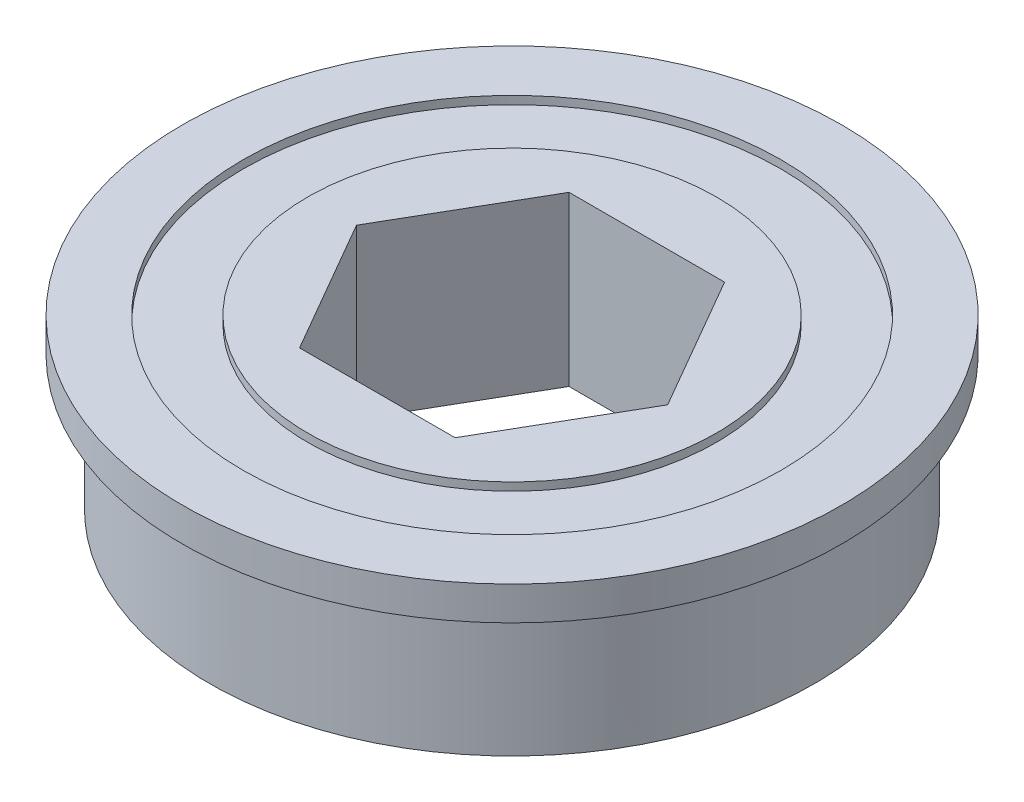
ISO-10303-21;
HEADER;
FILE_DESCRIPTION(('STEP AP214'),'2;1');
FILE_NAME('part.step','',(''),(''),'','','');
FILE_SCHEMA(('AUTOMOTIVE_DESIGN { 1 0 10303 214 1 1 1 1 }'));
ENDSEC;
DATA;
#1=APPLICATION_CONTEXT('core data for automotive mechanical design processes');
#2=APPLICATION_PROTOCOL_DEFINITION('international standard','automotive_design',2000,#1);
#3=PRODUCT_CONTEXT('',#1,'mechanical');
#4=PRODUCT('Part','Part','',(#3));
#5=PRODUCT_RELATED_PRODUCT_CATEGORY('part','',(#4));
#6=PRODUCT_DEFINITION_FORMATION('','',#4);
#7=PRODUCT_DEFINITION_CONTEXT('part definition',#1,'design');
#8=PRODUCT_DEFINITION('design','',#6,#7);
#9=PRODUCT_DEFINITION_SHAPE('','',#8);
#10=(LENGTH_UNIT() NAMED_UNIT(*) SI_UNIT(.MILLI.,.METRE.));
#11=(NAMED_UNIT(*) PLANE_ANGLE_UNIT() SI_UNIT($,.RADIAN.));
#12=(NAMED_UNIT(*) SI_UNIT($,.STERADIAN.) SOLID_ANGLE_UNIT());
#13=UNCERTAINTY_MEASURE_WITH_UNIT(LENGTH_MEASURE(1.E-05),#10,'distance_accuracy_value','');
#14=(GEOMETRIC_REPRESENTATION_CONTEXT(3) GLOBAL_UNCERTAINTY_ASSIGNED_CONTEXT((#13)) GLOBAL_UNIT_ASSIGNED_CONTEXT((#10,
#11,#12)) REPRESENTATION_CONTEXT('',''));
#15=CARTESIAN_POINT('',(0.,0.,0.));
#16=DIRECTION('',(0.,0.,1.));
#17=DIRECTION('',(1.,0.,0.));
#18=AXIS2_PLACEMENT_3D('',#15,#16,#17);
#19=CARTESIAN_POINT('',(3.67194771204602,0.,-6.36));
#20=DIRECTION('',(0.,0.,-1.));
#21=DIRECTION('',(-1.,0.,0.));
#22=AXIS2_PLACEMENT_3D('',#19,#20,#21);
#23=PLANE('',#22);
#24=DIRECTION('',(-1.,0.,0.));
#25=VECTOR('',#24,1.);
#26=CARTESIAN_POINT('',(3.67194771204602,7.9375,-6.36));
#27=LINE('',#26,#25);
#28=CARTESIAN_POINT('',(3.67194771204602,7.9375,-6.36));
#29=VERTEX_POINT('',#28);
#30=CARTESIAN_POINT('',(-3.67194771204602,7.9375,-6.36));
#31=VERTEX_POINT('',#30);
#32=EDGE_CURVE('E210',#29,#31,#27,.T.);
#33=ORIENTED_EDGE('',*,*,#32,.T.);
#34=DIRECTION('',(0.,1.,0.));
#35=VECTOR('',#34,1.);
#36=CARTESIAN_POINT('',(-3.67194771204602,0.,-6.36));
#37=LINE('',#36,#35);
#38=CARTESIAN_POINT('',(-3.67194771204602,0.,-6.36));
#39=VERTEX_POINT('',#38);
#40=EDGE_CURVE('E11',#39,#31,#37,.T.);
#41=ORIENTED_EDGE('',*,*,#40,.F.);
#42=DIRECTION('',(-1.,0.,0.));
#43=VECTOR('',#42,1.);
#44=CARTESIAN_POINT('',(3.67194771204602,0.,-6.36));
#45=LINE('',#44,#43);
#46=CARTESIAN_POINT('',(3.67194771204602,0.,-6.36));
#47=VERTEX_POINT('',#46);
#48=EDGE_CURVE('E175',#47,#39,#45,.T.);
#49=ORIENTED_EDGE('',*,*,#48,.F.);
#50=DIRECTION('',(0.,1.,0.));
#51=VECTOR('',#50,1.);
#52=CARTESIAN_POINT('',(3.67194771204602,0.,-6.36));
#53=LINE('',#52,#51);
#54=EDGE_CURVE('E211',#47,#29,#53,.T.);
#55=ORIENTED_EDGE('',*,*,#54,.T.);
#56=EDGE_LOOP('',(#33,#41,#49,#55));
#57=FACE_BOUND('',#56,.T.);
#58=ADVANCED_FACE('F17',(#57),#23,.F.);
#59=CARTESIAN_POINT('',(-3.67194771204602,0.,-6.36));
#60=DIRECTION('',(-0.866025403784439,0.,-0.5));
#61=DIRECTION('',(-0.5,0.,0.866025403784439));
#62=AXIS2_PLACEMENT_3D('',#59,#60,#61);
#63=PLANE('',#62);
#64=DIRECTION('',(-0.5,0.,0.866025403784439));
#65=VECTOR('',#64,1.);
#66=CARTESIAN_POINT('',(-3.67194771204602,7.9375,-6.36));
#67=LINE('',#66,#65);
#68=CARTESIAN_POINT('',(-7.34389542409204,7.9375,0.));
#69=VERTEX_POINT('',#68);
#70=EDGE_CURVE('E207',#31,#69,#67,.T.);
#71=ORIENTED_EDGE('',*,*,#70,.T.);
#72=DIRECTION('',(0.,1.,0.));
#73=VECTOR('',#72,1.);
#74=CARTESIAN_POINT('',(-7.34389542409204,0.,0.));
#75=LINE('',#74,#73);
#76=CARTESIAN_POINT('',(-7.34389542409204,0.,0.));
#77=VERTEX_POINT('',#76);
#78=EDGE_CURVE('E25',#77,#69,#75,.T.);
#79=ORIENTED_EDGE('',*,*,#78,.F.);
#80=DIRECTION('',(-0.5,0.,0.866025403784439));
#81=VECTOR('',#80,1.);
#82=CARTESIAN_POINT('',(-3.67194771204602,0.,-6.36));
#83=LINE('',#82,#81);
#84=EDGE_CURVE('E179',#39,#77,#83,.T.);
#85=ORIENTED_EDGE('',*,*,#84,.F.);
#86=ORIENTED_EDGE('',*,*,#40,.T.);
#87=EDGE_LOOP('',(#71,#79,#85,#86));
#88=FACE_BOUND('',#87,.T.);
#89=ADVANCED_FACE('F462',(#88),#63,.F.);
#90=CARTESIAN_POINT('',(-7.34389542409204,0.,0.));
#91=DIRECTION('',(-0.866025403784439,0.,0.5));
#92=DIRECTION('',(0.,1.,0.));
#93=AXIS2_PLACEMENT_3D('',#90,#91,#92);
#94=PLANE('',#93);
#95=DIRECTION('',(0.5,0.,0.866025403784439));
#96=VECTOR('',#95,1.);
#97=CARTESIAN_POINT('',(-7.34389542409204,7.9375,0.));
#98=LINE('',#97,#96);
#99=CARTESIAN_POINT('',(-3.67194771204601,7.9375,6.36));
#100=VERTEX_POINT('',#99);
#101=EDGE_CURVE('E204',#69,#100,#98,.T.);
#102=ORIENTED_EDGE('',*,*,#101,.T.);
#103=DIRECTION('',(0.,1.,0.));
#104=VECTOR('',#103,1.);
#105=CARTESIAN_POINT('',(-3.67194771204601,0.,6.36));
#106=LINE('',#105,#104);
#107=CARTESIAN_POINT('',(-3.67194771204601,0.,6.36));
#108=VERTEX_POINT('',#107);
#109=EDGE_CURVE('E220',#108,#100,#106,.T.);
#110=ORIENTED_EDGE('',*,*,#109,.F.);
#111=DIRECTION('',(0.5,0.,0.866025403784439));
#112=VECTOR('',#111,1.);
#113=CARTESIAN_POINT('',(-7.34389542409204,0.,0.));
#114=LINE('',#113,#112);
#115=EDGE_CURVE('E189',#77,#108,#114,.T.);
#116=ORIENTED_EDGE('',*,*,#115,.F.);
#117=ORIENTED_EDGE('',*,*,#78,.T.);
#118=EDGE_LOOP('',(#102,#110,#116,#117));
#119=FACE_BOUND('',#118,.T.);
#120=ADVANCED_FACE('F468',(#119),#94,.F.);
#121=CARTESIAN_POINT('',(-3.67194771204601,0.,6.36));
#122=DIRECTION('',(0.,0.,1.));
#123=DIRECTION('',(1.,0.,0.));
#124=AXIS2_PLACEMENT_3D('',#121,#122,#123);
#125=PLANE('',#124);
#126=DIRECTION('',(1.,0.,0.));
#127=VECTOR('',#126,1.);
#128=CARTESIAN_POINT('',(-3.67194771204601,7.9375,6.36));
#129=LINE('',#128,#127);
#130=CARTESIAN_POINT('',(3.67194771204602,7.9375,6.36));
#131=VERTEX_POINT('',#130);
#132=EDGE_CURVE('E200',#100,#131,#129,.T.);
#133=ORIENTED_EDGE('',*,*,#132,.T.);
#134=DIRECTION('',(0.,1.,0.));
#135=VECTOR('',#134,1.);
#136=CARTESIAN_POINT('',(3.67194771204602,0.,6.36));
#137=LINE('',#136,#135);
#138=CARTESIAN_POINT('',(3.67194771204602,0.,6.36));
#139=VERTEX_POINT('',#138);
#140=EDGE_CURVE('E217',#139,#131,#137,.T.);
#141=ORIENTED_EDGE('',*,*,#140,.F.);
#142=DIRECTION('',(1.,0.,0.));
#143=VECTOR('',#142,1.);
#144=CARTESIAN_POINT('',(-3.67194771204601,0.,6.36));
#145=LINE('',#144,#143);
#146=EDGE_CURVE('E185',#108,#139,#145,.T.);
#147=ORIENTED_EDGE('',*,*,#146,.F.);
#148=ORIENTED_EDGE('',*,*,#109,.T.);
#149=EDGE_LOOP('',(#133,#141,#147,#148));
#150=FACE_BOUND('',#149,.T.);
#151=ADVANCED_FACE('F489',(#150),#125,.F.);
#152=CARTESIAN_POINT('',(3.67194771204602,0.,6.36));
#153=DIRECTION('',(0.866025403784439,0.,0.5));
#154=DIRECTION('',(0.,-1.,0.));
#155=AXIS2_PLACEMENT_3D('',#152,#153,#154);
#156=PLANE('',#155);
#157=DIRECTION('',(0.5,0.,-0.866025403784439));
#158=VECTOR('',#157,1.);
#159=CARTESIAN_POINT('',(3.67194771204602,7.9375,6.36));
#160=LINE('',#159,#158);
#161=CARTESIAN_POINT('',(7.34389542409204,7.9375,0.));
#162=VERTEX_POINT('',#161);
#163=EDGE_CURVE('E196',#131,#162,#160,.T.);
#164=ORIENTED_EDGE('',*,*,#163,.T.);
#165=DIRECTION('',(0.,1.,0.));
#166=VECTOR('',#165,1.);
#167=CARTESIAN_POINT('',(7.34389542409204,0.,0.));
#168=LINE('',#167,#166);
#169=CARTESIAN_POINT('',(7.34389542409204,0.,0.));
#170=VERTEX_POINT('',#169);
#171=EDGE_CURVE('E214',#170,#162,#168,.T.);
#172=ORIENTED_EDGE('',*,*,#171,.F.);
#173=DIRECTION('',(0.5,0.,-0.866025403784439));
#174=VECTOR('',#173,1.);
#175=CARTESIAN_POINT('',(3.67194771204602,0.,6.36));
#176=LINE('',#175,#174);
#177=EDGE_CURVE('E180',#139,#170,#176,.T.);
#178=ORIENTED_EDGE('',*,*,#177,.F.);
#179=ORIENTED_EDGE('',*,*,#140,.T.);
#180=EDGE_LOOP('',(#164,#172,#178,#179));
#181=FACE_BOUND('',#180,.T.);
#182=ADVANCED_FACE('F487',(#181),#156,.F.);
#183=CARTESIAN_POINT('',(7.34389542409204,0.,0.));
#184=DIRECTION('',(0.866025403784439,0.,-0.5));
#185=DIRECTION('',(0.,-1.,0.));
#186=AXIS2_PLACEMENT_3D('',#183,#184,#185);
#187=PLANE('',#186);
#188=DIRECTION('',(-0.5,0.,-0.866025403784439));
#189=VECTOR('',#188,1.);
#190=CARTESIAN_POINT('',(7.34389542409204,7.9375,0.));
#191=LINE('',#190,#189);
#192=EDGE_CURVE('E184',#162,#29,#191,.T.);
#193=ORIENTED_EDGE('',*,*,#192,.T.);
#194=ORIENTED_EDGE('',*,*,#54,.F.);
#195=DIRECTION('',(-0.5,0.,-0.866025403784439));
#196=VECTOR('',#195,1.);
#197=CARTESIAN_POINT('',(7.34389542409204,0.,0.));
#198=LINE('',#197,#196);
#199=EDGE_CURVE('E174',#170,#47,#198,.T.);
#200=ORIENTED_EDGE('',*,*,#199,.F.);
#201=ORIENTED_EDGE('',*,*,#171,.T.);
#202=EDGE_LOOP('',(#193,#194,#200,#201));
#203=FACE_BOUND('',#202,.T.);
#204=ADVANCED_FACE('F484',(#203),#187,.F.);
#205=CARTESIAN_POINT('',(6.35,7.9375,0.));
#206=DIRECTION('',(0.,1.,0.));
#207=DIRECTION('',(1.,0.,0.));
#208=AXIS2_PLACEMENT_3D('',#205,#206,#207);
#209=PLANE('',#208);
#210=ORIENTED_EDGE('',*,*,#192,.F.);
#211=ORIENTED_EDGE('',*,*,#163,.F.);
#212=ORIENTED_EDGE('',*,*,#132,.F.);
#213=ORIENTED_EDGE('',*,*,#101,.F.);
#214=ORIENTED_EDGE('',*,*,#70,.F.);
#215=ORIENTED_EDGE('',*,*,#32,.F.);
#216=EDGE_LOOP('',(#210,#211,#212,#213,#214,#215));
#217=FACE_BOUND('',#216,.T.);
#218=CARTESIAN_POINT('',(0.,7.9375,0.));
#219=DIRECTION('',(0.,1.,0.));
#220=DIRECTION('',(0.,0.,1.));
#221=AXIS2_PLACEMENT_3D('',#218,#219,#220);
#222=CIRCLE('',#221,9.652);
#223=CARTESIAN_POINT('',(0.,7.9375,-9.652));
#224=VERTEX_POINT('',#223);
#225=EDGE_CURVE('E157',#224,#224,#222,.T.);
#226=ORIENTED_EDGE('',*,*,#225,.T.);
#227=EDGE_LOOP('',(#226));
#228=FACE_BOUND('',#227,.T.);
#229=ADVANCED_FACE('F475',(#217,#228),#209,.T.);
#230=CARTESIAN_POINT('',(9.652,0.,0.));
#231=DIRECTION('',(0.,-1.,0.));
#232=DIRECTION('',(0.,0.,-1.));
#233=AXIS2_PLACEMENT_3D('',#230,#231,#232);
#234=PLANE('',#233);
#235=ORIENTED_EDGE('',*,*,#199,.T.);
#236=ORIENTED_EDGE('',*,*,#48,.T.);
#237=ORIENTED_EDGE('',*,*,#84,.T.);
#238=ORIENTED_EDGE('',*,*,#115,.T.);
#239=ORIENTED_EDGE('',*,*,#146,.T.);
#240=ORIENTED_EDGE('',*,*,#177,.T.);
#241=EDGE_LOOP('',(#235,#236,#237,#238,#239,#240));
#242=FACE_BOUND('',#241,.T.);
#243=CARTESIAN_POINT('',(0.,0.,0.));
#244=DIRECTION('',(0.,1.,0.));
#245=DIRECTION('',(0.,0.,1.));
#246=AXIS2_PLACEMENT_3D('',#243,#244,#245);
#247=CIRCLE('',#246,9.652);
#248=CARTESIAN_POINT('',(0.,0.,-9.652));
#249=VERTEX_POINT('',#248);
#250=EDGE_CURVE('E384',#249,#249,#247,.T.);
#251=ORIENTED_EDGE('',*,*,#250,.F.);
#252=EDGE_LOOP('',(#251));
#253=FACE_BOUND('',#252,.T.);
#254=ADVANCED_FACE('F457',(#242,#253),#234,.T.);
#255=CARTESIAN_POINT('',(9.652,0.381,0.));
#256=DIRECTION('',(0.,-1.,0.));
#257=DIRECTION('',(0.,0.,-1.));
#258=AXIS2_PLACEMENT_3D('',#255,#256,#257);
#259=PLANE('',#258);
#260=CARTESIAN_POINT('',(0.,0.381,0.));
#261=DIRECTION('',(0.,1.,0.));
#262=DIRECTION('',(0.,0.,1.));
#263=AXIS2_PLACEMENT_3D('',#260,#261,#262);
#264=CIRCLE('',#263,9.652);
#265=CARTESIAN_POINT('',(0.,0.381,-9.652));
#266=VERTEX_POINT('',#265);
#267=EDGE_CURVE('E396',#266,#266,#264,.T.);
#268=ORIENTED_EDGE('',*,*,#267,.T.);
#269=EDGE_LOOP('',(#268));
#270=FACE_BOUND('',#269,.T.);
#271=CARTESIAN_POINT('',(0.,0.381,0.));
#272=DIRECTION('',(0.,1.,0.));
#273=DIRECTION('',(0.,0.,1.));
#274=AXIS2_PLACEMENT_3D('',#271,#272,#273);
#275=CIRCLE('',#274,12.7);
#276=CARTESIAN_POINT('',(0.,0.381,-12.7));
#277=VERTEX_POINT('',#276);
#278=EDGE_CURVE('E366',#277,#277,#275,.T.);
#279=ORIENTED_EDGE('',*,*,#278,.F.);
#280=EDGE_LOOP('',(#279));
#281=FACE_BOUND('',#280,.T.);
#282=ADVANCED_FACE('F446',(#270,#281),#259,.T.);
#283=CARTESIAN_POINT('',(14.2748,0.,0.));
#284=DIRECTION('',(0.,-1.,0.));
#285=DIRECTION('',(0.,0.,-1.));
#286=AXIS2_PLACEMENT_3D('',#283,#284,#285);
#287=PLANE('',#286);
#288=CARTESIAN_POINT('',(0.,0.,0.));
#289=DIRECTION('',(0.,1.,0.));
#290=DIRECTION('',(0.,0.,1.));
#291=AXIS2_PLACEMENT_3D('',#288,#289,#290);
#292=CIRCLE('',#291,12.7);
#293=CARTESIAN_POINT('',(0.,0.,-12.7));
#294=VERTEX_POINT('',#293);
#295=EDGE_CURVE('E378',#294,#294,#292,.T.);
#296=ORIENTED_EDGE('',*,*,#295,.T.);
#297=EDGE_LOOP('',(#296));
#298=FACE_BOUND('',#297,.T.);
#299=CARTESIAN_POINT('',(0.,0.,0.));
#300=DIRECTION('',(0.,1.,0.));
#301=DIRECTION('',(0.,0.,1.));
#302=AXIS2_PLACEMENT_3D('',#299,#300,#301);
#303=CIRCLE('',#302,14.2748);
#304=CARTESIAN_POINT('',(0.,0.,-14.2748));
#305=VERTEX_POINT('',#304);
#306=EDGE_CURVE('E338',#305,#305,#303,.T.);
#307=ORIENTED_EDGE('',*,*,#306,.F.);
#308=EDGE_LOOP('',(#307));
#309=FACE_BOUND('',#308,.T.);
#310=ADVANCED_FACE('F444',(#298,#309),#287,.T.);
#311=CARTESIAN_POINT('',(15.5575,6.35,0.));
#312=DIRECTION('',(0.,-1.,0.));
#313=DIRECTION('',(0.,0.,-1.));
#314=AXIS2_PLACEMENT_3D('',#311,#312,#313);
#315=PLANE('',#314);
#316=CARTESIAN_POINT('',(0.,6.35,0.));
#317=DIRECTION('',(0.,1.,0.));
#318=DIRECTION('',(0.,0.,1.));
#319=AXIS2_PLACEMENT_3D('',#316,#317,#318);
#320=CIRCLE('',#319,14.2748);
#321=CARTESIAN_POINT('',(0.,6.35,-14.2748));
#322=VERTEX_POINT('',#321);
#323=EDGE_CURVE('E420',#322,#322,#320,.T.);
#324=ORIENTED_EDGE('',*,*,#323,.T.);
#325=EDGE_LOOP('',(#324));
#326=FACE_BOUND('',#325,.T.);
#327=CARTESIAN_POINT('',(0.,6.35,0.));
#328=DIRECTION('',(0.,1.,0.));
#329=DIRECTION('',(0.,0.,1.));
#330=AXIS2_PLACEMENT_3D('',#327,#328,#329);
#331=CIRCLE('',#330,15.5575);
#332=CARTESIAN_POINT('',(0.,6.35,-15.5575));
#333=VERTEX_POINT('',#332);
#334=EDGE_CURVE('E314',#333,#333,#331,.T.);
#335=ORIENTED_EDGE('',*,*,#334,.F.);
#336=EDGE_LOOP('',(#335));
#337=FACE_BOUND('',#336,.T.);
#338=ADVANCED_FACE('F430',(#326,#337),#315,.T.);
#339=CARTESIAN_POINT('',(12.7,7.9375,0.));
#340=DIRECTION('',(0.,1.,0.));
#341=DIRECTION('',(1.,0.,0.));
#342=AXIS2_PLACEMENT_3D('',#339,#340,#341);
#343=PLANE('',#342);
#344=CARTESIAN_POINT('',(0.,7.9375,0.));
#345=DIRECTION('',(0.,1.,0.));
#346=DIRECTION('',(0.,0.,1.));
#347=AXIS2_PLACEMENT_3D('',#344,#345,#346);
#348=CIRCLE('',#347,12.7);
#349=CARTESIAN_POINT('',(0.,7.9375,-12.7));
#350=VERTEX_POINT('',#349);
#351=EDGE_CURVE('E150',#350,#350,#348,.T.);
#352=ORIENTED_EDGE('',*,*,#351,.F.);
#353=EDGE_LOOP('',(#352));
#354=FACE_BOUND('',#353,.T.);
#355=CARTESIAN_POINT('',(0.,7.9375,0.));
#356=DIRECTION('',(0.,1.,0.));
#357=DIRECTION('',(0.,0.,1.));
#358=AXIS2_PLACEMENT_3D('',#355,#356,#357);
#359=CIRCLE('',#358,15.5575);
#360=CARTESIAN_POINT('',(0.,7.9375,-15.5575));
#361=VERTEX_POINT('',#360);
#362=EDGE_CURVE('E325',#361,#361,#359,.T.);
#363=ORIENTED_EDGE('',*,*,#362,.T.);
#364=EDGE_LOOP('',(#363));
#365=FACE_BOUND('',#364,.T.);
#366=ADVANCED_FACE('F455',(#354,#365),#343,.T.);
#367=CARTESIAN_POINT('',(9.652,7.5565,0.));
#368=DIRECTION('',(0.,1.,0.));
#369=DIRECTION('',(1.,0.,0.));
#370=AXIS2_PLACEMENT_3D('',#367,#368,#369);
#371=PLANE('',#370);
#372=CARTESIAN_POINT('',(0.,7.5565,0.));
#373=DIRECTION('',(0.,1.,0.));
#374=DIRECTION('',(0.,0.,1.));
#375=AXIS2_PLACEMENT_3D('',#372,#373,#374);
#376=CIRCLE('',#375,9.652);
#377=CARTESIAN_POINT('',(0.,7.5565,-9.652));
#378=VERTEX_POINT('',#377);
#379=EDGE_CURVE('E171',#378,#378,#376,.T.);
#380=ORIENTED_EDGE('',*,*,#379,.F.);
#381=EDGE_LOOP('',(#380));
#382=FACE_BOUND('',#381,.T.);
#383=CARTESIAN_POINT('',(0.,7.5565,0.));
#384=DIRECTION('',(0.,1.,0.));
#385=DIRECTION('',(0.,0.,1.));
#386=AXIS2_PLACEMENT_3D('',#383,#384,#385);
#387=CIRCLE('',#386,12.7);
#388=CARTESIAN_POINT('',(0.,7.5565,-12.7));
#389=VERTEX_POINT('',#388);
#390=EDGE_CURVE('E167',#389,#389,#387,.T.);
#391=ORIENTED_EDGE('',*,*,#390,.T.);
#392=EDGE_LOOP('',(#391));
#393=FACE_BOUND('',#392,.T.);
#394=ADVANCED_FACE('F518',(#382,#393),#371,.T.);
#395=CARTESIAN_POINT('',(0.,0.,0.));
#396=DIRECTION('',(0.,1.,0.));
#397=DIRECTION('',(0.,0.,1.));
#398=AXIS2_PLACEMENT_3D('',#395,#396,#397);
#399=CYLINDRICAL_SURFACE('',#398,9.652);
#400=ORIENTED_EDGE('',*,*,#225,.F.);
#401=DIRECTION('',(0.,-1.,0.));
#402=VECTOR('',#401,1.);
#403=CARTESIAN_POINT('',(0.,0.,-9.652));
#404=LINE('',#403,#402);
#405=EDGE_CURVE('E165',#224,#378,#404,.T.);
#406=ORIENTED_EDGE('',*,*,#405,.T.);
#407=ORIENTED_EDGE('',*,*,#379,.T.);
#408=ORIENTED_EDGE('',*,*,#405,.F.);
#409=EDGE_LOOP('',(#400,#406,#407,#408));
#410=FACE_BOUND('',#409,.T.);
#411=ADVANCED_FACE('F515',(#410),#399,.T.);
#412=CARTESIAN_POINT('',(0.,0.,0.));
#413=DIRECTION('',(0.,1.,0.));
#414=DIRECTION('',(0.,0.,1.));
#415=AXIS2_PLACEMENT_3D('',#412,#413,#414);
#416=CYLINDRICAL_SURFACE('',#415,12.7);
#417=ORIENTED_EDGE('',*,*,#390,.F.);
#418=DIRECTION('',(0.,1.,0.));
#419=VECTOR('',#418,1.);
#420=CARTESIAN_POINT('',(0.,0.,-12.7));
#421=LINE('',#420,#419);
#422=EDGE_CURVE('E153',#389,#350,#421,.T.);
#423=ORIENTED_EDGE('',*,*,#422,.T.);
#424=ORIENTED_EDGE('',*,*,#351,.T.);
#425=ORIENTED_EDGE('',*,*,#422,.F.);
#426=EDGE_LOOP('',(#417,#423,#424,#425));
#427=FACE_BOUND('',#426,.T.);
#428=ADVANCED_FACE('F152',(#427),#416,.F.);
#429=CARTESIAN_POINT('',(0.,0.,0.));
#430=DIRECTION('',(0.,1.,0.));
#431=DIRECTION('',(0.,0.,1.));
#432=AXIS2_PLACEMENT_3D('',#429,#430,#431);
#433=CYLINDRICAL_SURFACE('',#432,15.5575);
#434=ORIENTED_EDGE('',*,*,#362,.F.);
#435=DIRECTION('',(0.,-1.,0.));
#436=VECTOR('',#435,1.);
#437=CARTESIAN_POINT('',(0.,0.,-15.5575));
#438=LINE('',#437,#436);
#439=EDGE_CURVE('E318',#361,#333,#438,.T.);
#440=ORIENTED_EDGE('',*,*,#439,.T.);
#441=ORIENTED_EDGE('',*,*,#334,.T.);
#442=ORIENTED_EDGE('',*,*,#439,.F.);
#443=EDGE_LOOP('',(#434,#440,#441,#442));
#444=FACE_BOUND('',#443,.T.);
#445=ADVANCED_FACE('F514',(#444),#433,.T.);
#446=CARTESIAN_POINT('',(0.,5.975,0.));
#447=DIRECTION('',(0.,-1.,0.));
#448=DIRECTION('',(0.,0.,-1.));
#449=AXIS2_PLACEMENT_3D('',#446,#447,#448);
#450=CONICAL_SURFACE('',#449,14.0582936490539,0.523598775598298);
#451=CARTESIAN_POINT('',(0.,5.6,0.));
#452=DIRECTION('',(0.,1.,0.));
#453=DIRECTION('',(0.,0.,1.));
#454=AXIS2_PLACEMENT_3D('',#451,#452,#453);
#455=CIRCLE('',#454,14.2748);
#456=CARTESIAN_POINT('',(0.,5.6,14.2748));
#457=VERTEX_POINT('',#456);
#458=CARTESIAN_POINT('',(0.,5.6,-14.2748));
#459=VERTEX_POINT('',#458);
#460=EDGE_CURVE('E359',#457,#459,#455,.T.);
#461=ORIENTED_EDGE('',*,*,#460,.T.);
#462=CARTESIAN_POINT('',(0.,5.6,0.));
#463=DIRECTION('',(0.,1.,0.));
#464=DIRECTION('',(0.,0.,1.));
#465=AXIS2_PLACEMENT_3D('',#462,#463,#464);
#466=CIRCLE('',#465,14.2748);
#467=EDGE_CURVE('E351',#459,#457,#466,.T.);
#468=ORIENTED_EDGE('',*,*,#467,.T.);
#469=DIRECTION('',(0.,0.866025403784439,-0.5));
#470=VECTOR('',#469,1.);
#471=CARTESIAN_POINT('',(0.,5.975,14.0582936490539));
#472=LINE('',#471,#470);
#473=CARTESIAN_POINT('',(0.,5.975,14.0582936490539));
#474=VERTEX_POINT('',#473);
#475=EDGE_CURVE('E332',#457,#474,#472,.T.);
#476=ORIENTED_EDGE('',*,*,#475,.T.);
#477=CARTESIAN_POINT('',(0.,5.975,0.));
#478=DIRECTION('',(0.,1.,0.));
#479=DIRECTION('',(0.,0.,1.));
#480=AXIS2_PLACEMENT_3D('',#477,#478,#479);
#481=CIRCLE('',#480,14.0582936490539);
#482=CARTESIAN_POINT('',(0.,5.975,-14.0582936490539));
#483=VERTEX_POINT('',#482);
#484=EDGE_CURVE('E408',#483,#474,#481,.T.);
#485=ORIENTED_EDGE('',*,*,#484,.F.);
#486=CARTESIAN_POINT('',(0.,5.975,0.));
#487=DIRECTION('',(0.,1.,0.));
#488=DIRECTION('',(0.,0.,1.));
#489=AXIS2_PLACEMENT_3D('',#486,#487,#488);
#490=CIRCLE('',#489,14.0582936490539);
#491=EDGE_CURVE('E403',#474,#483,#490,.T.);
#492=ORIENTED_EDGE('',*,*,#491,.F.);
#493=ORIENTED_EDGE('',*,*,#475,.F.);
#494=EDGE_LOOP('',(#461,#468,#476,#485,#492,#493));
#495=FACE_BOUND('',#494,.T.);
#496=ADVANCED_FACE('F437',(#495),#450,.T.);
#497=CARTESIAN_POINT('',(0.,0.,0.));
#498=DIRECTION('',(0.,1.,0.));
#499=DIRECTION('',(0.,0.,1.));
#500=AXIS2_PLACEMENT_3D('',#497,#498,#499);
#501=CYLINDRICAL_SURFACE('',#500,14.2748);
#502=ORIENTED_EDGE('',*,*,#460,.F.);
#503=ORIENTED_EDGE('',*,*,#467,.F.);
#504=DIRECTION('',(0.,-1.,0.));
#505=VECTOR('',#504,1.);
#506=CARTESIAN_POINT('',(0.,0.,-14.2748));
#507=LINE('',#506,#505);
#508=EDGE_CURVE('E344',#459,#305,#507,.T.);
#509=ORIENTED_EDGE('',*,*,#508,.T.);
#510=ORIENTED_EDGE('',*,*,#306,.T.);
#511=ORIENTED_EDGE('',*,*,#508,.F.);
#512=EDGE_LOOP('',(#502,#503,#509,#510,#511));
#513=FACE_BOUND('',#512,.T.);
#514=ADVANCED_FACE('F441',(#513),#501,.T.);
#515=CARTESIAN_POINT('',(0.,0.,0.));
#516=DIRECTION('',(0.,1.,0.));
#517=DIRECTION('',(0.,0.,1.));
#518=AXIS2_PLACEMENT_3D('',#515,#516,#517);
#519=CYLINDRICAL_SURFACE('',#518,12.7);
#520=ORIENTED_EDGE('',*,*,#295,.F.);
#521=DIRECTION('',(0.,1.,0.));
#522=VECTOR('',#521,1.);
#523=CARTESIAN_POINT('',(0.,0.,-12.7));
#524=LINE('',#523,#522);
#525=EDGE_CURVE('E372',#294,#277,#524,.T.);
#526=ORIENTED_EDGE('',*,*,#525,.T.);
#527=ORIENTED_EDGE('',*,*,#278,.T.);
#528=ORIENTED_EDGE('',*,*,#525,.F.);
#529=EDGE_LOOP('',(#520,#526,#527,#528));
#530=FACE_BOUND('',#529,.T.);
#531=ADVANCED_FACE('F540',(#530),#519,.F.);
#532=CARTESIAN_POINT('',(0.,0.,0.));
#533=DIRECTION('',(0.,1.,0.));
#534=DIRECTION('',(0.,0.,1.));
#535=AXIS2_PLACEMENT_3D('',#532,#533,#534);
#536=CYLINDRICAL_SURFACE('',#535,9.652);
#537=ORIENTED_EDGE('',*,*,#267,.F.);
#538=DIRECTION('',(0.,-1.,0.));
#539=VECTOR('',#538,1.);
#540=CARTESIAN_POINT('',(0.,0.,-9.652));
#541=LINE('',#540,#539);
#542=EDGE_CURVE('E389',#266,#249,#541,.T.);
#543=ORIENTED_EDGE('',*,*,#542,.T.);
#544=ORIENTED_EDGE('',*,*,#250,.T.);
#545=ORIENTED_EDGE('',*,*,#542,.F.);
#546=EDGE_LOOP('',(#537,#543,#544,#545));
#547=FACE_BOUND('',#546,.T.);
#548=ADVANCED_FACE('F547',(#547),#536,.T.);
#549=CARTESIAN_POINT('',(0.,6.1,0.));
#550=DIRECTION('',(0.,1.,0.));
#551=DIRECTION('',(0.,0.,1.));
#552=AXIS2_PLACEMENT_3D('',#549,#550,#551);
#553=TOROIDAL_SURFACE('',#552,14.2748,0.25);
#554=ORIENTED_EDGE('',*,*,#323,.F.);
#555=CARTESIAN_POINT('',(0.,6.1,-14.2748));
#556=DIRECTION('',(1.,0.,0.));
#557=DIRECTION('',(0.,0.,-1.));
#558=AXIS2_PLACEMENT_3D('',#555,#556,#557);
#559=CIRCLE('',#558,0.25);
#560=EDGE_CURVE('E414',#322,#483,#559,.T.);
#561=ORIENTED_EDGE('',*,*,#560,.T.);
#562=ORIENTED_EDGE('',*,*,#484,.T.);
#563=ORIENTED_EDGE('',*,*,#491,.T.);
#564=ORIENTED_EDGE('',*,*,#560,.F.);
#565=EDGE_LOOP('',(#554,#561,#562,#563,#564));
#566=FACE_BOUND('',#565,.T.);
#567=ADVANCED_FACE('F433',(#566),#553,.F.);
#568=CLOSED_SHELL('',(#58,#89,#120,#151,#182,#204,#229,#254,#282,#310,#338,#366,#394,#411,#428,
#445,#496,#514,#531,#548,#567));
#569=MANIFOLD_SOLID_BREP('B1',#568);
#570=ADVANCED_BREP_SHAPE_REPRESENTATION('',(#18,#569),#14);
#571=SHAPE_DEFINITION_REPRESENTATION(#9,#570);
ENDSEC;
END-ISO-10303-21;
